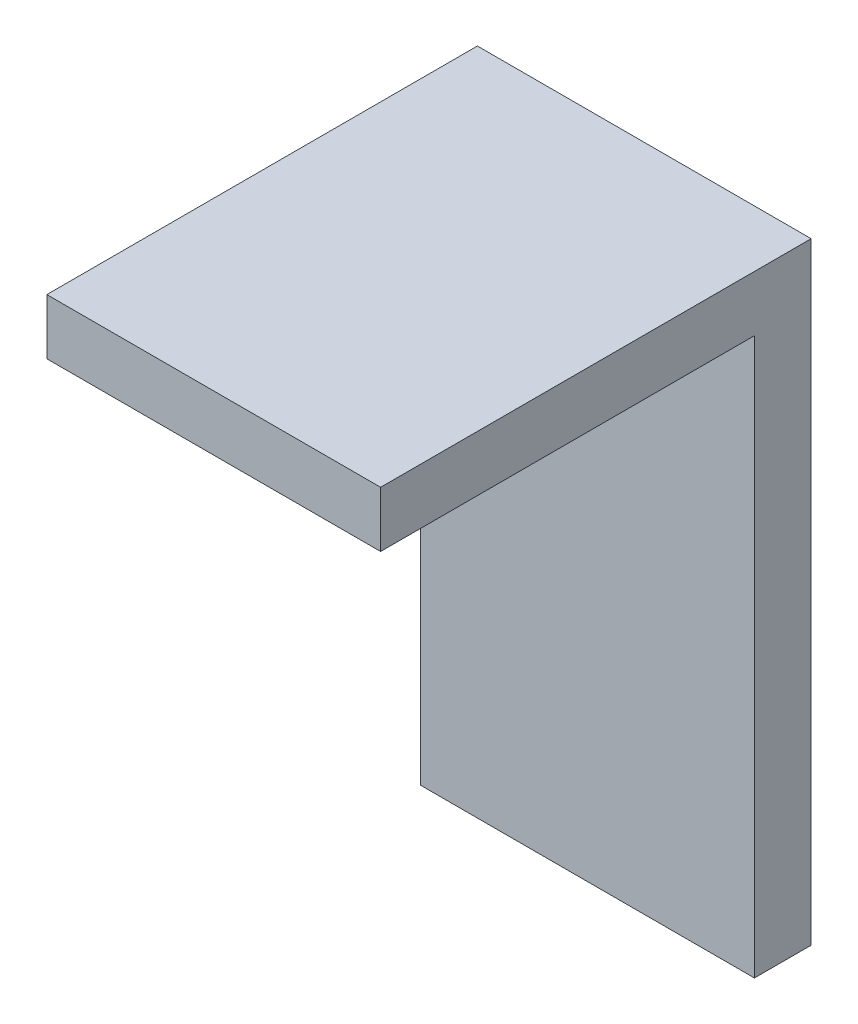
ISO-10303-21;
HEADER;
FILE_DESCRIPTION(('STEP AP214'),'2;1');
FILE_NAME('part.step','',(''),(''),'','','');
FILE_SCHEMA(('AUTOMOTIVE_DESIGN { 1 0 10303 214 1 1 1 1 }'));
ENDSEC;
DATA;
#1=APPLICATION_CONTEXT('core data for automotive mechanical design processes');
#2=APPLICATION_PROTOCOL_DEFINITION('international standard','automotive_design',2000,#1);
#3=PRODUCT_CONTEXT('',#1,'mechanical');
#4=PRODUCT('Part','Part','',(#3));
#5=PRODUCT_RELATED_PRODUCT_CATEGORY('part','',(#4));
#6=PRODUCT_DEFINITION_FORMATION('','',#4);
#7=PRODUCT_DEFINITION_CONTEXT('part definition',#1,'design');
#8=PRODUCT_DEFINITION('design','',#6,#7);
#9=PRODUCT_DEFINITION_SHAPE('','',#8);
#10=(LENGTH_UNIT() NAMED_UNIT(*) SI_UNIT(.MILLI.,.METRE.));
#11=(NAMED_UNIT(*) PLANE_ANGLE_UNIT() SI_UNIT($,.RADIAN.));
#12=(NAMED_UNIT(*) SI_UNIT($,.STERADIAN.) SOLID_ANGLE_UNIT());
#13=UNCERTAINTY_MEASURE_WITH_UNIT(LENGTH_MEASURE(1.E-05),#10,'distance_accuracy_value','');
#14=(GEOMETRIC_REPRESENTATION_CONTEXT(3) GLOBAL_UNCERTAINTY_ASSIGNED_CONTEXT((#13)) GLOBAL_UNIT_ASSIGNED_CONTEXT((#10,
#11,#12)) REPRESENTATION_CONTEXT('',''));
#15=CARTESIAN_POINT('',(0.,0.,0.));
#16=DIRECTION('',(0.,0.,1.));
#17=DIRECTION('',(1.,0.,0.));
#18=AXIS2_PLACEMENT_3D('',#15,#16,#17);
#19=CARTESIAN_POINT('',(3.6,4.55,0.));
#20=DIRECTION('',(-1.,0.,0.));
#21=DIRECTION('',(0.,0.,1.));
#22=AXIS2_PLACEMENT_3D('',#19,#20,#21);
#23=PLANE('',#22);
#24=DIRECTION('',(0.,1.,0.));
#25=VECTOR('',#24,1.);
#26=CARTESIAN_POINT('',(3.6,4.,0.));
#27=LINE('',#26,#25);
#28=CARTESIAN_POINT('',(3.6,4.,0.));
#29=VERTEX_POINT('',#28);
#30=CARTESIAN_POINT('',(3.6,4.55,0.));
#31=VERTEX_POINT('',#30);
#32=EDGE_CURVE('E11',#29,#31,#27,.T.);
#33=ORIENTED_EDGE('',*,*,#32,.F.);
#34=DIRECTION('',(0.,0.,-1.));
#35=VECTOR('',#34,1.);
#36=CARTESIAN_POINT('',(3.6,4.,0.051));
#37=LINE('',#36,#35);
#38=CARTESIAN_POINT('',(3.6,4.,0.051));
#39=VERTEX_POINT('',#38);
#40=EDGE_CURVE('E24',#39,#29,#37,.T.);
#41=ORIENTED_EDGE('',*,*,#40,.F.);
#42=DIRECTION('',(0.,-1.,0.));
#43=VECTOR('',#42,1.);
#44=CARTESIAN_POINT('',(3.6,4.5,0.051));
#45=LINE('',#44,#43);
#46=CARTESIAN_POINT('',(3.6,4.5,0.051));
#47=VERTEX_POINT('',#46);
#48=EDGE_CURVE('E87',#47,#39,#45,.T.);
#49=ORIENTED_EDGE('',*,*,#48,.F.);
#50=DIRECTION('',(0.,0.,-1.));
#51=VECTOR('',#50,1.);
#52=CARTESIAN_POINT('',(3.6,4.5,0.387));
#53=LINE('',#52,#51);
#54=CARTESIAN_POINT('',(3.6,4.5,0.387));
#55=VERTEX_POINT('',#54);
#56=EDGE_CURVE('E114',#55,#47,#53,.T.);
#57=ORIENTED_EDGE('',*,*,#56,.F.);
#58=DIRECTION('',(0.,-1.,0.));
#59=VECTOR('',#58,1.);
#60=CARTESIAN_POINT('',(3.6,4.55,0.387));
#61=LINE('',#60,#59);
#62=CARTESIAN_POINT('',(3.6,4.55,0.387));
#63=VERTEX_POINT('',#62);
#64=EDGE_CURVE('E111',#63,#55,#61,.T.);
#65=ORIENTED_EDGE('',*,*,#64,.F.);
#66=DIRECTION('',(0.,0.,1.));
#67=VECTOR('',#66,1.);
#68=CARTESIAN_POINT('',(3.6,4.55,0.));
#69=LINE('',#68,#67);
#70=EDGE_CURVE('E108',#31,#63,#69,.T.);
#71=ORIENTED_EDGE('',*,*,#70,.F.);
#72=EDGE_LOOP('',(#33,#41,#49,#57,#65,#71));
#73=FACE_BOUND('',#72,.T.);
#74=ADVANCED_FACE('F17',(#73),#23,.T.);
#75=CARTESIAN_POINT('',(3.9,4.,0.));
#76=DIRECTION('',(1.,0.,0.));
#77=DIRECTION('',(0.,0.,1.));
#78=AXIS2_PLACEMENT_3D('',#75,#76,#77);
#79=PLANE('',#78);
#80=DIRECTION('',(0.,-1.,0.));
#81=VECTOR('',#80,1.);
#82=CARTESIAN_POINT('',(3.9,4.55,0.));
#83=LINE('',#82,#81);
#84=CARTESIAN_POINT('',(3.9,4.55,0.));
#85=VERTEX_POINT('',#84);
#86=CARTESIAN_POINT('',(3.9,4.,0.));
#87=VERTEX_POINT('',#86);
#88=EDGE_CURVE('E106',#85,#87,#83,.T.);
#89=ORIENTED_EDGE('',*,*,#88,.F.);
#90=DIRECTION('',(0.,0.,-1.));
#91=VECTOR('',#90,1.);
#92=CARTESIAN_POINT('',(3.9,4.55,0.387));
#93=LINE('',#92,#91);
#94=CARTESIAN_POINT('',(3.9,4.55,0.387));
#95=VERTEX_POINT('',#94);
#96=EDGE_CURVE('E103',#95,#85,#93,.T.);
#97=ORIENTED_EDGE('',*,*,#96,.F.);
#98=DIRECTION('',(0.,1.,0.));
#99=VECTOR('',#98,1.);
#100=CARTESIAN_POINT('',(3.9,4.5,0.387));
#101=LINE('',#100,#99);
#102=CARTESIAN_POINT('',(3.9,4.5,0.387));
#103=VERTEX_POINT('',#102);
#104=EDGE_CURVE('E100',#103,#95,#101,.T.);
#105=ORIENTED_EDGE('',*,*,#104,.F.);
#106=DIRECTION('',(0.,0.,1.));
#107=VECTOR('',#106,1.);
#108=CARTESIAN_POINT('',(3.9,4.5,0.051));
#109=LINE('',#108,#107);
#110=CARTESIAN_POINT('',(3.9,4.5,0.051));
#111=VERTEX_POINT('',#110);
#112=EDGE_CURVE('E72',#111,#103,#109,.T.);
#113=ORIENTED_EDGE('',*,*,#112,.F.);
#114=DIRECTION('',(0.,1.,0.));
#115=VECTOR('',#114,1.);
#116=CARTESIAN_POINT('',(3.9,4.,0.051));
#117=LINE('',#116,#115);
#118=CARTESIAN_POINT('',(3.9,4.,0.051));
#119=VERTEX_POINT('',#118);
#120=EDGE_CURVE('E66',#119,#111,#117,.T.);
#121=ORIENTED_EDGE('',*,*,#120,.F.);
#122=DIRECTION('',(0.,0.,1.));
#123=VECTOR('',#122,1.);
#124=CARTESIAN_POINT('',(3.9,4.,0.));
#125=LINE('',#124,#123);
#126=EDGE_CURVE('E69',#87,#119,#125,.T.);
#127=ORIENTED_EDGE('',*,*,#126,.F.);
#128=EDGE_LOOP('',(#89,#97,#105,#113,#121,#127));
#129=FACE_BOUND('',#128,.T.);
#130=ADVANCED_FACE('F68',(#129),#79,.T.);
#131=CARTESIAN_POINT('',(3.6,4.55,0.387));
#132=DIRECTION('',(0.,0.,1.));
#133=DIRECTION('',(0.,1.,0.));
#134=AXIS2_PLACEMENT_3D('',#131,#132,#133);
#135=PLANE('',#134);
#136=ORIENTED_EDGE('',*,*,#64,.T.);
#137=DIRECTION('',(-1.,0.,0.));
#138=VECTOR('',#137,1.);
#139=CARTESIAN_POINT('',(3.9,4.5,0.387));
#140=LINE('',#139,#138);
#141=EDGE_CURVE('E83',#103,#55,#140,.T.);
#142=ORIENTED_EDGE('',*,*,#141,.F.);
#143=ORIENTED_EDGE('',*,*,#104,.T.);
#144=DIRECTION('',(1.,0.,0.));
#145=VECTOR('',#144,1.);
#146=CARTESIAN_POINT('',(3.6,4.55,0.387));
#147=LINE('',#146,#145);
#148=EDGE_CURVE('E88',#63,#95,#147,.T.);
#149=ORIENTED_EDGE('',*,*,#148,.F.);
#150=EDGE_LOOP('',(#136,#142,#143,#149));
#151=FACE_BOUND('',#150,.T.);
#152=ADVANCED_FACE('F125',(#151),#135,.T.);
#153=CARTESIAN_POINT('',(3.6,4.5,0.051));
#154=DIRECTION('',(0.,0.,1.));
#155=DIRECTION('',(0.,1.,0.));
#156=AXIS2_PLACEMENT_3D('',#153,#154,#155);
#157=PLANE('',#156);
#158=ORIENTED_EDGE('',*,*,#48,.T.);
#159=DIRECTION('',(-1.,0.,0.));
#160=VECTOR('',#159,1.);
#161=CARTESIAN_POINT('',(3.9,4.,0.051));
#162=LINE('',#161,#160);
#163=EDGE_CURVE('E81',#119,#39,#162,.T.);
#164=ORIENTED_EDGE('',*,*,#163,.F.);
#165=ORIENTED_EDGE('',*,*,#120,.T.);
#166=DIRECTION('',(1.,0.,0.));
#167=VECTOR('',#166,1.);
#168=CARTESIAN_POINT('',(3.6,4.5,0.051));
#169=LINE('',#168,#167);
#170=EDGE_CURVE('E89',#47,#111,#169,.T.);
#171=ORIENTED_EDGE('',*,*,#170,.F.);
#172=EDGE_LOOP('',(#158,#164,#165,#171));
#173=FACE_BOUND('',#172,.T.);
#174=ADVANCED_FACE('F86',(#173),#157,.T.);
#175=CARTESIAN_POINT('',(3.9,4.55,0.));
#176=DIRECTION('',(0.,1.,0.));
#177=DIRECTION('',(0.,0.,1.));
#178=AXIS2_PLACEMENT_3D('',#175,#176,#177);
#179=PLANE('',#178);
#180=DIRECTION('',(1.,0.,0.));
#181=VECTOR('',#180,1.);
#182=CARTESIAN_POINT('',(3.6,4.55,0.));
#183=LINE('',#182,#181);
#184=EDGE_CURVE('E93',#31,#85,#183,.T.);
#185=ORIENTED_EDGE('',*,*,#184,.F.);
#186=ORIENTED_EDGE('',*,*,#70,.T.);
#187=ORIENTED_EDGE('',*,*,#148,.T.);
#188=ORIENTED_EDGE('',*,*,#96,.T.);
#189=EDGE_LOOP('',(#185,#186,#187,#188));
#190=FACE_BOUND('',#189,.T.);
#191=ADVANCED_FACE('F121',(#190),#179,.T.);
#192=CARTESIAN_POINT('',(3.6,4.,0.));
#193=DIRECTION('',(0.,-1.,0.));
#194=DIRECTION('',(0.,0.,1.));
#195=AXIS2_PLACEMENT_3D('',#192,#193,#194);
#196=PLANE('',#195);
#197=DIRECTION('',(-1.,0.,0.));
#198=VECTOR('',#197,1.);
#199=CARTESIAN_POINT('',(3.9,4.,0.));
#200=LINE('',#199,#198);
#201=EDGE_CURVE('E82',#87,#29,#200,.T.);
#202=ORIENTED_EDGE('',*,*,#201,.F.);
#203=ORIENTED_EDGE('',*,*,#126,.T.);
#204=ORIENTED_EDGE('',*,*,#163,.T.);
#205=ORIENTED_EDGE('',*,*,#40,.T.);
#206=EDGE_LOOP('',(#202,#203,#204,#205));
#207=FACE_BOUND('',#206,.T.);
#208=ADVANCED_FACE('F80',(#207),#196,.T.);
#209=CARTESIAN_POINT('',(3.6,4.5,0.051));
#210=DIRECTION('',(0.,-1.,0.));
#211=DIRECTION('',(0.,0.,1.));
#212=AXIS2_PLACEMENT_3D('',#209,#210,#211);
#213=PLANE('',#212);
#214=ORIENTED_EDGE('',*,*,#170,.T.);
#215=ORIENTED_EDGE('',*,*,#112,.T.);
#216=ORIENTED_EDGE('',*,*,#141,.T.);
#217=ORIENTED_EDGE('',*,*,#56,.T.);
#218=EDGE_LOOP('',(#214,#215,#216,#217));
#219=FACE_BOUND('',#218,.T.);
#220=ADVANCED_FACE('F127',(#219),#213,.T.);
#221=CARTESIAN_POINT('',(3.9,4.55,0.));
#222=DIRECTION('',(0.,0.,-1.));
#223=DIRECTION('',(0.,1.,0.));
#224=AXIS2_PLACEMENT_3D('',#221,#222,#223);
#225=PLANE('',#224);
#226=ORIENTED_EDGE('',*,*,#88,.T.);
#227=ORIENTED_EDGE('',*,*,#201,.T.);
#228=ORIENTED_EDGE('',*,*,#32,.T.);
#229=ORIENTED_EDGE('',*,*,#184,.T.);
#230=EDGE_LOOP('',(#226,#227,#228,#229));
#231=FACE_BOUND('',#230,.T.);
#232=ADVANCED_FACE('F117',(#231),#225,.T.);
#233=CLOSED_SHELL('',(#74,#130,#152,#174,#191,#208,#220,#232));
#234=MANIFOLD_SOLID_BREP('B1',#233);
#235=ADVANCED_BREP_SHAPE_REPRESENTATION('',(#18,#234),#14);
#236=SHAPE_DEFINITION_REPRESENTATION(#9,#235);
ENDSEC;
END-ISO-10303-21;
